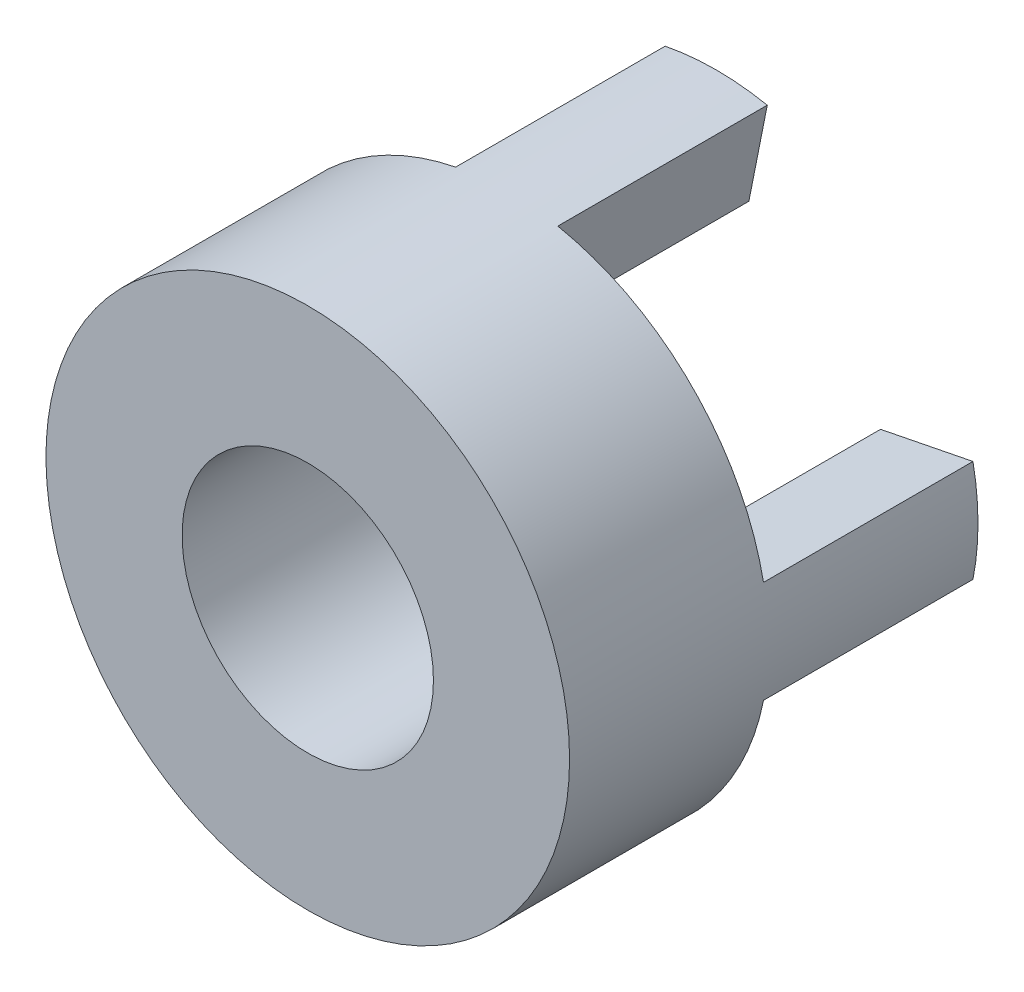
ISO-10303-21;
HEADER;
FILE_DESCRIPTION(('STEP AP214'),'2;1');
FILE_NAME('part.step','',(''),(''),'','','');
FILE_SCHEMA(('AUTOMOTIVE_DESIGN { 1 0 10303 214 1 1 1 1 }'));
ENDSEC;
DATA;
#1=APPLICATION_CONTEXT('core data for automotive mechanical design processes');
#2=APPLICATION_PROTOCOL_DEFINITION('international standard','automotive_design',2000,#1);
#3=PRODUCT_CONTEXT('',#1,'mechanical');
#4=PRODUCT('Part','Part','',(#3));
#5=PRODUCT_RELATED_PRODUCT_CATEGORY('part','',(#4));
#6=PRODUCT_DEFINITION_FORMATION('','',#4);
#7=PRODUCT_DEFINITION_CONTEXT('part definition',#1,'design');
#8=PRODUCT_DEFINITION('design','',#6,#7);
#9=PRODUCT_DEFINITION_SHAPE('','',#8);
#10=(LENGTH_UNIT() NAMED_UNIT(*) SI_UNIT(.MILLI.,.METRE.));
#11=(NAMED_UNIT(*) PLANE_ANGLE_UNIT() SI_UNIT($,.RADIAN.));
#12=(NAMED_UNIT(*) SI_UNIT($,.STERADIAN.) SOLID_ANGLE_UNIT());
#13=UNCERTAINTY_MEASURE_WITH_UNIT(LENGTH_MEASURE(1.E-05),#10,'distance_accuracy_value','');
#14=(GEOMETRIC_REPRESENTATION_CONTEXT(3) GLOBAL_UNCERTAINTY_ASSIGNED_CONTEXT((#13)) GLOBAL_UNIT_ASSIGNED_CONTEXT((#10,
#11,#12)) REPRESENTATION_CONTEXT('',''));
#15=CARTESIAN_POINT('',(0.,0.,0.));
#16=DIRECTION('',(0.,0.,1.));
#17=DIRECTION('',(1.,0.,0.));
#18=AXIS2_PLACEMENT_3D('',#15,#16,#17);
#19=CARTESIAN_POINT('',(0.,0.,0.));
#20=DIRECTION('',(0.,0.,1.));
#21=DIRECTION('',(1.,0.,0.));
#22=AXIS2_PLACEMENT_3D('',#19,#20,#21);
#23=PLANE('',#22);
#24=CARTESIAN_POINT('',(0.,0.,0.));
#25=DIRECTION('',(0.,0.,1.));
#26=DIRECTION('',(1.,0.,0.));
#27=AXIS2_PLACEMENT_3D('',#24,#25,#26);
#28=CIRCLE('',#27,6.);
#29=CARTESIAN_POINT('',(6.,0.,0.));
#30=VERTEX_POINT('',#29);
#31=EDGE_CURVE('E255',#30,#30,#28,.T.);
#32=ORIENTED_EDGE('',*,*,#31,.T.);
#33=EDGE_LOOP('',(#32));
#34=FACE_BOUND('',#33,.T.);
#35=DIRECTION('',(-0.195090322016129,-0.98078528040323,0.));
#36=VECTOR('',#35,1.);
#37=CARTESIAN_POINT('',(2.43862902520161,12.2598160050404,0.));
#38=LINE('',#37,#36);
#39=CARTESIAN_POINT('',(2.43862902520161,12.2598160050404,0.));
#40=VERTEX_POINT('',#39);
#41=CARTESIAN_POINT('',(1.56072257612903,7.84628224322584,0.));
#42=VERTEX_POINT('',#41);
#43=EDGE_CURVE('E477',#40,#42,#38,.T.);
#44=ORIENTED_EDGE('',*,*,#43,.F.);
#45=CARTESIAN_POINT('',(0.,0.,0.));
#46=DIRECTION('',(0.,0.,1.));
#47=DIRECTION('',(1.,0.,0.));
#48=AXIS2_PLACEMENT_3D('',#45,#46,#47);
#49=CIRCLE('',#48,12.5);
#50=CARTESIAN_POINT('',(12.2598160050404,2.43862902520161,0.));
#51=VERTEX_POINT('',#50);
#52=EDGE_CURVE('E169',#51,#40,#49,.T.);
#53=ORIENTED_EDGE('',*,*,#52,.F.);
#54=DIRECTION('',(0.98078528040323,0.195090322016129,0.));
#55=VECTOR('',#54,1.);
#56=CARTESIAN_POINT('',(7.84628224322584,1.56072257612903,0.));
#57=LINE('',#56,#55);
#58=CARTESIAN_POINT('',(7.84628224322584,1.56072257612903,0.));
#59=VERTEX_POINT('',#58);
#60=EDGE_CURVE('E182',#59,#51,#57,.T.);
#61=ORIENTED_EDGE('',*,*,#60,.F.);
#62=CARTESIAN_POINT('',(0.,0.,0.));
#63=DIRECTION('',(0.,0.,1.));
#64=DIRECTION('',(-1.,0.,0.));
#65=AXIS2_PLACEMENT_3D('',#62,#63,#64);
#66=CIRCLE('',#65,8.);
#67=CARTESIAN_POINT('',(7.84628224322584,-1.56072257612903,0.));
#68=VERTEX_POINT('',#67);
#69=EDGE_CURVE('E172',#68,#59,#66,.T.);
#70=ORIENTED_EDGE('',*,*,#69,.F.);
#71=DIRECTION('',(-0.98078528040323,0.195090322016129,0.));
#72=VECTOR('',#71,1.);
#73=CARTESIAN_POINT('',(12.2598160050404,-2.43862902520161,0.));
#74=LINE('',#73,#72);
#75=CARTESIAN_POINT('',(12.2598160050404,-2.43862902520161,0.));
#76=VERTEX_POINT('',#75);
#77=EDGE_CURVE('E170',#76,#68,#74,.T.);
#78=ORIENTED_EDGE('',*,*,#77,.F.);
#79=CARTESIAN_POINT('',(2.43862902520161,-12.2598160050404,0.));
#80=VERTEX_POINT('',#79);
#81=EDGE_CURVE('E461',#80,#76,#49,.T.);
#82=ORIENTED_EDGE('',*,*,#81,.F.);
#83=DIRECTION('',(0.195090322016129,-0.98078528040323,0.));
#84=VECTOR('',#83,1.);
#85=CARTESIAN_POINT('',(1.56072257612903,-7.84628224322584,0.));
#86=LINE('',#85,#84);
#87=CARTESIAN_POINT('',(1.56072257612903,-7.84628224322584,0.));
#88=VERTEX_POINT('',#87);
#89=EDGE_CURVE('E204',#88,#80,#86,.T.);
#90=ORIENTED_EDGE('',*,*,#89,.F.);
#91=CARTESIAN_POINT('',(0.,0.,0.));
#92=DIRECTION('',(0.,0.,1.));
#93=DIRECTION('',(-1.,0.,0.));
#94=AXIS2_PLACEMENT_3D('',#91,#92,#93);
#95=CIRCLE('',#94,8.);
#96=CARTESIAN_POINT('',(-1.56072257612901,-7.84628224322585,0.));
#97=VERTEX_POINT('',#96);
#98=EDGE_CURVE('E212',#97,#88,#95,.T.);
#99=ORIENTED_EDGE('',*,*,#98,.F.);
#100=DIRECTION('',(0.195090322016133,0.980785280403229,0.));
#101=VECTOR('',#100,1.);
#102=CARTESIAN_POINT('',(-2.43862902520161,-12.2598160050404,0.));
#103=LINE('',#102,#101);
#104=CARTESIAN_POINT('',(-2.43862902520161,-12.2598160050404,0.));
#105=VERTEX_POINT('',#104);
#106=EDGE_CURVE('E199',#105,#97,#103,.T.);
#107=ORIENTED_EDGE('',*,*,#106,.F.);
#108=CARTESIAN_POINT('',(-12.2598160050404,-2.43862902520161,0.));
#109=VERTEX_POINT('',#108);
#110=EDGE_CURVE('E39',#109,#105,#49,.T.);
#111=ORIENTED_EDGE('',*,*,#110,.F.);
#112=DIRECTION('',(-0.98078528040323,-0.195090322016129,0.));
#113=VECTOR('',#112,1.);
#114=CARTESIAN_POINT('',(-7.84628224322584,-1.56072257612903,0.));
#115=LINE('',#114,#113);
#116=CARTESIAN_POINT('',(-7.84628224322584,-1.56072257612903,0.));
#117=VERTEX_POINT('',#116);
#118=EDGE_CURVE('E230',#117,#109,#115,.T.);
#119=ORIENTED_EDGE('',*,*,#118,.F.);
#120=CARTESIAN_POINT('',(0.,0.,0.));
#121=DIRECTION('',(0.,0.,1.));
#122=DIRECTION('',(-1.,0.,0.));
#123=AXIS2_PLACEMENT_3D('',#120,#121,#122);
#124=CIRCLE('',#123,8.);
#125=CARTESIAN_POINT('',(-7.84628224322584,1.56072257612903,0.));
#126=VERTEX_POINT('',#125);
#127=EDGE_CURVE('E239',#126,#117,#124,.T.);
#128=ORIENTED_EDGE('',*,*,#127,.F.);
#129=DIRECTION('',(0.98078528040323,-0.195090322016129,0.));
#130=VECTOR('',#129,1.);
#131=CARTESIAN_POINT('',(-12.2598160050404,2.43862902520161,0.));
#132=LINE('',#131,#130);
#133=CARTESIAN_POINT('',(-12.2598160050404,2.43862902520161,0.));
#134=VERTEX_POINT('',#133);
#135=EDGE_CURVE('E225',#134,#126,#132,.T.);
#136=ORIENTED_EDGE('',*,*,#135,.F.);
#137=CARTESIAN_POINT('',(-2.43862902520161,12.2598160050404,0.));
#138=VERTEX_POINT('',#137);
#139=EDGE_CURVE('E259',#138,#134,#49,.T.);
#140=ORIENTED_EDGE('',*,*,#139,.F.);
#141=DIRECTION('',(-0.195090322016129,0.98078528040323,0.));
#142=VECTOR('',#141,1.);
#143=CARTESIAN_POINT('',(-1.56072257612903,7.84628224322584,0.));
#144=LINE('',#143,#142);
#145=CARTESIAN_POINT('',(-1.56072257612903,7.84628224322584,0.));
#146=VERTEX_POINT('',#145);
#147=EDGE_CURVE('E165',#146,#138,#144,.T.);
#148=ORIENTED_EDGE('',*,*,#147,.F.);
#149=CARTESIAN_POINT('',(0.,0.,0.));
#150=DIRECTION('',(0.,0.,1.));
#151=DIRECTION('',(-1.,0.,0.));
#152=AXIS2_PLACEMENT_3D('',#149,#150,#151);
#153=CIRCLE('',#152,8.);
#154=EDGE_CURVE('E457',#42,#146,#153,.T.);
#155=ORIENTED_EDGE('',*,*,#154,.F.);
#156=EDGE_LOOP('',(#44,#53,#61,#70,#78,#82,#90,#99,#107,#111,#119,#128,#136,#140,#148,#155));
#157=FACE_BOUND('',#156,.T.);
#158=ADVANCED_FACE('F35',(#34,#157),#23,.F.);
#159=CARTESIAN_POINT('',(0.,0.,9.5));
#160=DIRECTION('',(0.,0.,1.));
#161=DIRECTION('',(1.,0.,0.));
#162=AXIS2_PLACEMENT_3D('',#159,#160,#161);
#163=PLANE('',#162);
#164=CARTESIAN_POINT('',(0.,0.,9.5));
#165=DIRECTION('',(0.,0.,1.));
#166=DIRECTION('',(1.,0.,0.));
#167=AXIS2_PLACEMENT_3D('',#164,#165,#166);
#168=CIRCLE('',#167,12.5);
#169=CARTESIAN_POINT('',(12.5,0.,9.5));
#170=VERTEX_POINT('',#169);
#171=EDGE_CURVE('E11',#170,#170,#168,.T.);
#172=ORIENTED_EDGE('',*,*,#171,.T.);
#173=EDGE_LOOP('',(#172));
#174=FACE_BOUND('',#173,.T.);
#175=CARTESIAN_POINT('',(0.,0.,9.5));
#176=DIRECTION('',(0.,0.,1.));
#177=DIRECTION('',(1.,0.,0.));
#178=AXIS2_PLACEMENT_3D('',#175,#176,#177);
#179=CIRCLE('',#178,6.);
#180=CARTESIAN_POINT('',(6.,0.,9.5));
#181=VERTEX_POINT('',#180);
#182=EDGE_CURVE('E256',#181,#181,#179,.T.);
#183=ORIENTED_EDGE('',*,*,#182,.F.);
#184=EDGE_LOOP('',(#183));
#185=FACE_BOUND('',#184,.T.);
#186=ADVANCED_FACE('F277',(#174,#185),#163,.T.);
#187=CARTESIAN_POINT('',(0.,0.,9.5));
#188=DIRECTION('',(0.,0.,-1.));
#189=DIRECTION('',(-1.,0.,0.));
#190=AXIS2_PLACEMENT_3D('',#187,#188,#189);
#191=CYLINDRICAL_SURFACE('',#190,12.5);
#192=ORIENTED_EDGE('',*,*,#171,.F.);
#193=EDGE_LOOP('',(#192));
#194=FACE_BOUND('',#193,.T.);
#195=ORIENTED_EDGE('',*,*,#110,.T.);
#196=DIRECTION('',(0.,0.,1.));
#197=VECTOR('',#196,1.);
#198=CARTESIAN_POINT('',(-2.43862902520161,-12.2598160050404,-10.));
#199=LINE('',#198,#197);
#200=CARTESIAN_POINT('',(-2.43862902520161,-12.2598160050404,-10.));
#201=VERTEX_POINT('',#200);
#202=EDGE_CURVE('E223',#201,#105,#199,.T.);
#203=ORIENTED_EDGE('',*,*,#202,.F.);
#204=CARTESIAN_POINT('',(0.,0.,-10.));
#205=DIRECTION('',(0.,0.,-1.));
#206=DIRECTION('',(-1.,0.,0.));
#207=AXIS2_PLACEMENT_3D('',#204,#205,#206);
#208=CIRCLE('',#207,12.5);
#209=CARTESIAN_POINT('',(2.43862902520161,-12.2598160050404,-10.));
#210=VERTEX_POINT('',#209);
#211=EDGE_CURVE('E200',#210,#201,#208,.T.);
#212=ORIENTED_EDGE('',*,*,#211,.F.);
#213=DIRECTION('',(0.,0.,1.));
#214=VECTOR('',#213,1.);
#215=CARTESIAN_POINT('',(2.43862902520161,-12.2598160050404,-10.));
#216=LINE('',#215,#214);
#217=EDGE_CURVE('E210',#210,#80,#216,.T.);
#218=ORIENTED_EDGE('',*,*,#217,.T.);
#219=ORIENTED_EDGE('',*,*,#81,.T.);
#220=DIRECTION('',(0.,0.,1.));
#221=VECTOR('',#220,1.);
#222=CARTESIAN_POINT('',(12.2598160050404,-2.43862902520161,-10.));
#223=LINE('',#222,#221);
#224=CARTESIAN_POINT('',(12.2598160050404,-2.43862902520161,-10.));
#225=VERTEX_POINT('',#224);
#226=EDGE_CURVE('E197',#225,#76,#223,.T.);
#227=ORIENTED_EDGE('',*,*,#226,.F.);
#228=CARTESIAN_POINT('',(0.,0.,-10.));
#229=DIRECTION('',(0.,0.,-1.));
#230=DIRECTION('',(-1.,0.,0.));
#231=AXIS2_PLACEMENT_3D('',#228,#229,#230);
#232=CIRCLE('',#231,12.5);
#233=CARTESIAN_POINT('',(12.2598160050404,2.43862902520161,-10.));
#234=VERTEX_POINT('',#233);
#235=EDGE_CURVE('E178',#234,#225,#232,.T.);
#236=ORIENTED_EDGE('',*,*,#235,.F.);
#237=DIRECTION('',(0.,0.,1.));
#238=VECTOR('',#237,1.);
#239=CARTESIAN_POINT('',(12.2598160050404,2.43862902520161,-10.));
#240=LINE('',#239,#238);
#241=EDGE_CURVE('E57',#234,#51,#240,.T.);
#242=ORIENTED_EDGE('',*,*,#241,.T.);
#243=ORIENTED_EDGE('',*,*,#52,.T.);
#244=DIRECTION('',(0.,0.,1.));
#245=VECTOR('',#244,1.);
#246=CARTESIAN_POINT('',(2.43862902520161,12.2598160050404,-10.));
#247=LINE('',#246,#245);
#248=CARTESIAN_POINT('',(2.43862902520161,12.2598160050404,-10.));
#249=VERTEX_POINT('',#248);
#250=EDGE_CURVE('E153',#249,#40,#247,.T.);
#251=ORIENTED_EDGE('',*,*,#250,.F.);
#252=CARTESIAN_POINT('',(0.,0.,-10.));
#253=DIRECTION('',(0.,0.,-1.));
#254=DIRECTION('',(-1.,0.,0.));
#255=AXIS2_PLACEMENT_3D('',#252,#253,#254);
#256=CIRCLE('',#255,12.5);
#257=CARTESIAN_POINT('',(-2.43862902520161,12.2598160050404,-10.));
#258=VERTEX_POINT('',#257);
#259=EDGE_CURVE('E160',#258,#249,#256,.T.);
#260=ORIENTED_EDGE('',*,*,#259,.F.);
#261=DIRECTION('',(0.,0.,1.));
#262=VECTOR('',#261,1.);
#263=CARTESIAN_POINT('',(-2.43862902520161,12.2598160050404,-10.));
#264=LINE('',#263,#262);
#265=EDGE_CURVE('E50',#258,#138,#264,.T.);
#266=ORIENTED_EDGE('',*,*,#265,.T.);
#267=ORIENTED_EDGE('',*,*,#139,.T.);
#268=DIRECTION('',(0.,0.,1.));
#269=VECTOR('',#268,1.);
#270=CARTESIAN_POINT('',(-12.2598160050404,2.43862902520161,-10.));
#271=LINE('',#270,#269);
#272=CARTESIAN_POINT('',(-12.2598160050404,2.43862902520161,-10.));
#273=VERTEX_POINT('',#272);
#274=EDGE_CURVE('E252',#273,#134,#271,.T.);
#275=ORIENTED_EDGE('',*,*,#274,.F.);
#276=CARTESIAN_POINT('',(0.,0.,-10.));
#277=DIRECTION('',(0.,0.,-1.));
#278=DIRECTION('',(-1.,0.,0.));
#279=AXIS2_PLACEMENT_3D('',#276,#277,#278);
#280=CIRCLE('',#279,12.5);
#281=CARTESIAN_POINT('',(-12.2598160050404,-2.43862902520161,-10.));
#282=VERTEX_POINT('',#281);
#283=EDGE_CURVE('E226',#282,#273,#280,.T.);
#284=ORIENTED_EDGE('',*,*,#283,.F.);
#285=DIRECTION('',(0.,0.,1.));
#286=VECTOR('',#285,1.);
#287=CARTESIAN_POINT('',(-12.2598160050404,-2.43862902520161,-10.));
#288=LINE('',#287,#286);
#289=EDGE_CURVE('E236',#282,#109,#288,.T.);
#290=ORIENTED_EDGE('',*,*,#289,.T.);
#291=EDGE_LOOP('',(#195,#203,#212,#218,#219,#227,#236,#242,#243,#251,#260,#266,#267,#275,#284,#290));
#292=FACE_BOUND('',#291,.T.);
#293=ADVANCED_FACE('F37',(#194,#292),#191,.T.);
#294=CARTESIAN_POINT('',(0.,0.,9.5));
#295=DIRECTION('',(0.,0.,-1.));
#296=DIRECTION('',(-1.,0.,0.));
#297=AXIS2_PLACEMENT_3D('',#294,#295,#296);
#298=CYLINDRICAL_SURFACE('',#297,6.);
#299=ORIENTED_EDGE('',*,*,#182,.T.);
#300=EDGE_LOOP('',(#299));
#301=FACE_BOUND('',#300,.T.);
#302=ORIENTED_EDGE('',*,*,#31,.F.);
#303=EDGE_LOOP('',(#302));
#304=FACE_BOUND('',#303,.T.);
#305=ADVANCED_FACE('F265',(#301,#304),#298,.F.);
#306=CARTESIAN_POINT('',(-12.2598160050404,2.43862902520161,-10.));
#307=DIRECTION('',(-0.195090322016129,-0.98078528040323,0.));
#308=DIRECTION('',(0.98078528040323,-0.195090322016129,0.));
#309=AXIS2_PLACEMENT_3D('',#306,#307,#308);
#310=PLANE('',#309);
#311=ORIENTED_EDGE('',*,*,#135,.T.);
#312=DIRECTION('',(0.,0.,1.));
#313=VECTOR('',#312,1.);
#314=CARTESIAN_POINT('',(-7.84628224322584,1.56072257612903,-10.));
#315=LINE('',#314,#313);
#316=CARTESIAN_POINT('',(-7.84628224322584,1.56072257612903,-10.));
#317=VERTEX_POINT('',#316);
#318=EDGE_CURVE('E249',#317,#126,#315,.T.);
#319=ORIENTED_EDGE('',*,*,#318,.F.);
#320=DIRECTION('',(0.98078528040323,-0.195090322016129,0.));
#321=VECTOR('',#320,1.);
#322=CARTESIAN_POINT('',(-12.2598160050404,2.43862902520161,-10.));
#323=LINE('',#322,#321);
#324=EDGE_CURVE('E229',#273,#317,#323,.T.);
#325=ORIENTED_EDGE('',*,*,#324,.F.);
#326=ORIENTED_EDGE('',*,*,#274,.T.);
#327=EDGE_LOOP('',(#311,#319,#325,#326));
#328=FACE_BOUND('',#327,.T.);
#329=ADVANCED_FACE('F267',(#328),#310,.F.);
#330=CARTESIAN_POINT('',(0.,0.,-10.));
#331=DIRECTION('',(0.,0.,1.));
#332=DIRECTION('',(1.,0.,0.));
#333=AXIS2_PLACEMENT_3D('',#330,#331,#332);
#334=CYLINDRICAL_SURFACE('',#333,8.);
#335=ORIENTED_EDGE('',*,*,#127,.T.);
#336=DIRECTION('',(0.,0.,1.));
#337=VECTOR('',#336,1.);
#338=CARTESIAN_POINT('',(-7.84628224322584,-1.56072257612903,-10.));
#339=LINE('',#338,#337);
#340=CARTESIAN_POINT('',(-7.84628224322584,-1.56072257612903,-10.));
#341=VERTEX_POINT('',#340);
#342=EDGE_CURVE('E246',#341,#117,#339,.T.);
#343=ORIENTED_EDGE('',*,*,#342,.F.);
#344=CARTESIAN_POINT('',(0.,0.,-10.));
#345=DIRECTION('',(0.,0.,1.));
#346=DIRECTION('',(-1.,0.,0.));
#347=AXIS2_PLACEMENT_3D('',#344,#345,#346);
#348=CIRCLE('',#347,8.);
#349=EDGE_CURVE('E232',#317,#341,#348,.T.);
#350=ORIENTED_EDGE('',*,*,#349,.F.);
#351=ORIENTED_EDGE('',*,*,#318,.T.);
#352=EDGE_LOOP('',(#335,#343,#350,#351));
#353=FACE_BOUND('',#352,.T.);
#354=ADVANCED_FACE('F274',(#353),#334,.F.);
#355=CARTESIAN_POINT('',(-7.84628224322584,-1.56072257612903,-10.));
#356=DIRECTION('',(-0.195090322016129,0.98078528040323,0.));
#357=DIRECTION('',(-0.98078528040323,-0.195090322016129,0.));
#358=AXIS2_PLACEMENT_3D('',#355,#356,#357);
#359=PLANE('',#358);
#360=ORIENTED_EDGE('',*,*,#118,.T.);
#361=ORIENTED_EDGE('',*,*,#289,.F.);
#362=DIRECTION('',(-0.98078528040323,-0.195090322016129,0.));
#363=VECTOR('',#362,1.);
#364=CARTESIAN_POINT('',(-7.84628224322584,-1.56072257612903,-10.));
#365=LINE('',#364,#363);
#366=EDGE_CURVE('E234',#341,#282,#365,.T.);
#367=ORIENTED_EDGE('',*,*,#366,.F.);
#368=ORIENTED_EDGE('',*,*,#342,.T.);
#369=EDGE_LOOP('',(#360,#361,#367,#368));
#370=FACE_BOUND('',#369,.T.);
#371=ADVANCED_FACE('F312',(#370),#359,.F.);
#372=CARTESIAN_POINT('',(0.,0.,-10.));
#373=DIRECTION('',(0.,0.,-1.));
#374=DIRECTION('',(-1.,0.,0.));
#375=AXIS2_PLACEMENT_3D('',#372,#373,#374);
#376=PLANE('',#375);
#377=ORIENTED_EDGE('',*,*,#283,.T.);
#378=ORIENTED_EDGE('',*,*,#324,.T.);
#379=ORIENTED_EDGE('',*,*,#349,.T.);
#380=ORIENTED_EDGE('',*,*,#366,.T.);
#381=EDGE_LOOP('',(#377,#378,#379,#380));
#382=FACE_BOUND('',#381,.T.);
#383=ADVANCED_FACE('F322',(#382),#376,.T.);
#384=CARTESIAN_POINT('',(-2.43862902520161,-12.2598160050404,-10.));
#385=DIRECTION('',(0.980785280403229,-0.195090322016133,0.));
#386=DIRECTION('',(0.195090322016133,0.98078528040323,0.));
#387=AXIS2_PLACEMENT_3D('',#384,#385,#386);
#388=PLANE('',#387);
#389=ORIENTED_EDGE('',*,*,#106,.T.);
#390=DIRECTION('',(0.,0.,1.));
#391=VECTOR('',#390,1.);
#392=CARTESIAN_POINT('',(-1.56072257612901,-7.84628224322585,-10.));
#393=LINE('',#392,#391);
#394=CARTESIAN_POINT('',(-1.56072257612901,-7.84628224322585,-10.));
#395=VERTEX_POINT('',#394);
#396=EDGE_CURVE('E220',#395,#97,#393,.T.);
#397=ORIENTED_EDGE('',*,*,#396,.F.);
#398=DIRECTION('',(0.195090322016133,0.980785280403229,0.));
#399=VECTOR('',#398,1.);
#400=CARTESIAN_POINT('',(-2.43862902520161,-12.2598160050404,-10.));
#401=LINE('',#400,#399);
#402=EDGE_CURVE('E203',#201,#395,#401,.T.);
#403=ORIENTED_EDGE('',*,*,#402,.F.);
#404=ORIENTED_EDGE('',*,*,#202,.T.);
#405=EDGE_LOOP('',(#389,#397,#403,#404));
#406=FACE_BOUND('',#405,.T.);
#407=ADVANCED_FACE('F332',(#406),#388,.F.);
#408=CARTESIAN_POINT('',(0.,0.,-10.));
#409=DIRECTION('',(0.,0.,1.));
#410=DIRECTION('',(1.,0.,0.));
#411=AXIS2_PLACEMENT_3D('',#408,#409,#410);
#412=CYLINDRICAL_SURFACE('',#411,8.);
#413=ORIENTED_EDGE('',*,*,#98,.T.);
#414=DIRECTION('',(0.,0.,1.));
#415=VECTOR('',#414,1.);
#416=CARTESIAN_POINT('',(1.56072257612903,-7.84628224322584,-10.));
#417=LINE('',#416,#415);
#418=CARTESIAN_POINT('',(1.56072257612903,-7.84628224322584,-10.));
#419=VERTEX_POINT('',#418);
#420=EDGE_CURVE('E217',#419,#88,#417,.T.);
#421=ORIENTED_EDGE('',*,*,#420,.F.);
#422=CARTESIAN_POINT('',(0.,0.,-10.));
#423=DIRECTION('',(0.,0.,1.));
#424=DIRECTION('',(-1.,0.,0.));
#425=AXIS2_PLACEMENT_3D('',#422,#423,#424);
#426=CIRCLE('',#425,8.);
#427=EDGE_CURVE('E206',#395,#419,#426,.T.);
#428=ORIENTED_EDGE('',*,*,#427,.F.);
#429=ORIENTED_EDGE('',*,*,#396,.T.);
#430=EDGE_LOOP('',(#413,#421,#428,#429));
#431=FACE_BOUND('',#430,.T.);
#432=ADVANCED_FACE('F342',(#431),#412,.F.);
#433=CARTESIAN_POINT('',(1.56072257612903,-7.84628224322584,-10.));
#434=DIRECTION('',(-0.98078528040323,-0.195090322016129,0.));
#435=DIRECTION('',(0.195090322016129,-0.98078528040323,0.));
#436=AXIS2_PLACEMENT_3D('',#433,#434,#435);
#437=PLANE('',#436);
#438=ORIENTED_EDGE('',*,*,#89,.T.);
#439=ORIENTED_EDGE('',*,*,#217,.F.);
#440=DIRECTION('',(0.195090322016129,-0.98078528040323,0.));
#441=VECTOR('',#440,1.);
#442=CARTESIAN_POINT('',(1.56072257612903,-7.84628224322584,-10.));
#443=LINE('',#442,#441);
#444=EDGE_CURVE('E208',#419,#210,#443,.T.);
#445=ORIENTED_EDGE('',*,*,#444,.F.);
#446=ORIENTED_EDGE('',*,*,#420,.T.);
#447=EDGE_LOOP('',(#438,#439,#445,#446));
#448=FACE_BOUND('',#447,.T.);
#449=ADVANCED_FACE('F352',(#448),#437,.F.);
#450=CARTESIAN_POINT('',(0.,0.,-10.));
#451=DIRECTION('',(0.,0.,-1.));
#452=DIRECTION('',(-1.,0.,0.));
#453=AXIS2_PLACEMENT_3D('',#450,#451,#452);
#454=PLANE('',#453);
#455=ORIENTED_EDGE('',*,*,#211,.T.);
#456=ORIENTED_EDGE('',*,*,#402,.T.);
#457=ORIENTED_EDGE('',*,*,#427,.T.);
#458=ORIENTED_EDGE('',*,*,#444,.T.);
#459=EDGE_LOOP('',(#455,#456,#457,#458));
#460=FACE_BOUND('',#459,.T.);
#461=ADVANCED_FACE('F362',(#460),#454,.T.);
#462=CARTESIAN_POINT('',(12.2598160050404,-2.43862902520161,-10.));
#463=DIRECTION('',(0.195090322016129,0.98078528040323,0.));
#464=DIRECTION('',(-0.98078528040323,0.195090322016129,0.));
#465=AXIS2_PLACEMENT_3D('',#462,#463,#464);
#466=PLANE('',#465);
#467=ORIENTED_EDGE('',*,*,#77,.T.);
#468=DIRECTION('',(0.,0.,1.));
#469=VECTOR('',#468,1.);
#470=CARTESIAN_POINT('',(7.84628224322584,-1.56072257612903,-10.));
#471=LINE('',#470,#469);
#472=CARTESIAN_POINT('',(7.84628224322584,-1.56072257612903,-10.));
#473=VERTEX_POINT('',#472);
#474=EDGE_CURVE('E194',#473,#68,#471,.T.);
#475=ORIENTED_EDGE('',*,*,#474,.F.);
#476=DIRECTION('',(-0.98078528040323,0.195090322016129,0.));
#477=VECTOR('',#476,1.);
#478=CARTESIAN_POINT('',(12.2598160050404,-2.43862902520161,-10.));
#479=LINE('',#478,#477);
#480=EDGE_CURVE('E181',#225,#473,#479,.T.);
#481=ORIENTED_EDGE('',*,*,#480,.F.);
#482=ORIENTED_EDGE('',*,*,#226,.T.);
#483=EDGE_LOOP('',(#467,#475,#481,#482));
#484=FACE_BOUND('',#483,.T.);
#485=ADVANCED_FACE('F372',(#484),#466,.F.);
#486=CARTESIAN_POINT('',(0.,0.,-10.));
#487=DIRECTION('',(0.,0.,1.));
#488=DIRECTION('',(1.,0.,0.));
#489=AXIS2_PLACEMENT_3D('',#486,#487,#488);
#490=CYLINDRICAL_SURFACE('',#489,8.);
#491=ORIENTED_EDGE('',*,*,#69,.T.);
#492=DIRECTION('',(0.,0.,1.));
#493=VECTOR('',#492,1.);
#494=CARTESIAN_POINT('',(7.84628224322584,1.56072257612903,-10.));
#495=LINE('',#494,#493);
#496=CARTESIAN_POINT('',(7.84628224322584,1.56072257612903,-10.));
#497=VERTEX_POINT('',#496);
#498=EDGE_CURVE('E191',#497,#59,#495,.T.);
#499=ORIENTED_EDGE('',*,*,#498,.F.);
#500=CARTESIAN_POINT('',(0.,0.,-10.));
#501=DIRECTION('',(0.,0.,1.));
#502=DIRECTION('',(-1.,0.,0.));
#503=AXIS2_PLACEMENT_3D('',#500,#501,#502);
#504=CIRCLE('',#503,8.);
#505=EDGE_CURVE('E184',#473,#497,#504,.T.);
#506=ORIENTED_EDGE('',*,*,#505,.F.);
#507=ORIENTED_EDGE('',*,*,#474,.T.);
#508=EDGE_LOOP('',(#491,#499,#506,#507));
#509=FACE_BOUND('',#508,.T.);
#510=ADVANCED_FACE('F382',(#509),#490,.F.);
#511=CARTESIAN_POINT('',(7.84628224322584,1.56072257612903,-10.));
#512=DIRECTION('',(0.195090322016129,-0.98078528040323,0.));
#513=DIRECTION('',(0.98078528040323,0.195090322016129,0.));
#514=AXIS2_PLACEMENT_3D('',#511,#512,#513);
#515=PLANE('',#514);
#516=ORIENTED_EDGE('',*,*,#60,.T.);
#517=ORIENTED_EDGE('',*,*,#241,.F.);
#518=DIRECTION('',(0.98078528040323,0.195090322016129,0.));
#519=VECTOR('',#518,1.);
#520=CARTESIAN_POINT('',(7.84628224322584,1.56072257612903,-10.));
#521=LINE('',#520,#519);
#522=EDGE_CURVE('E186',#497,#234,#521,.T.);
#523=ORIENTED_EDGE('',*,*,#522,.F.);
#524=ORIENTED_EDGE('',*,*,#498,.T.);
#525=EDGE_LOOP('',(#516,#517,#523,#524));
#526=FACE_BOUND('',#525,.T.);
#527=ADVANCED_FACE('F392',(#526),#515,.F.);
#528=CARTESIAN_POINT('',(0.,0.,-10.));
#529=DIRECTION('',(0.,0.,-1.));
#530=DIRECTION('',(-1.,0.,0.));
#531=AXIS2_PLACEMENT_3D('',#528,#529,#530);
#532=PLANE('',#531);
#533=ORIENTED_EDGE('',*,*,#235,.T.);
#534=ORIENTED_EDGE('',*,*,#480,.T.);
#535=ORIENTED_EDGE('',*,*,#505,.T.);
#536=ORIENTED_EDGE('',*,*,#522,.T.);
#537=EDGE_LOOP('',(#533,#534,#535,#536));
#538=FACE_BOUND('',#537,.T.);
#539=ADVANCED_FACE('F402',(#538),#532,.T.);
#540=CARTESIAN_POINT('',(2.43862902520161,12.2598160050404,-10.));
#541=DIRECTION('',(-0.98078528040323,0.195090322016129,0.));
#542=DIRECTION('',(-0.195090322016129,-0.98078528040323,0.));
#543=AXIS2_PLACEMENT_3D('',#540,#541,#542);
#544=PLANE('',#543);
#545=ORIENTED_EDGE('',*,*,#43,.T.);
#546=DIRECTION('',(0.,0.,1.));
#547=VECTOR('',#546,1.);
#548=CARTESIAN_POINT('',(1.56072257612903,7.84628224322584,-10.));
#549=LINE('',#548,#547);
#550=CARTESIAN_POINT('',(1.56072257612903,7.84628224322584,-10.));
#551=VERTEX_POINT('',#550);
#552=EDGE_CURVE('E156',#551,#42,#549,.T.);
#553=ORIENTED_EDGE('',*,*,#552,.F.);
#554=DIRECTION('',(-0.195090322016129,-0.98078528040323,0.));
#555=VECTOR('',#554,1.);
#556=CARTESIAN_POINT('',(2.43862902520161,12.2598160050404,-10.));
#557=LINE('',#556,#555);
#558=EDGE_CURVE('E149',#249,#551,#557,.T.);
#559=ORIENTED_EDGE('',*,*,#558,.F.);
#560=ORIENTED_EDGE('',*,*,#250,.T.);
#561=EDGE_LOOP('',(#545,#553,#559,#560));
#562=FACE_BOUND('',#561,.T.);
#563=ADVANCED_FACE('F151',(#562),#544,.F.);
#564=CARTESIAN_POINT('',(0.,0.,-10.));
#565=DIRECTION('',(0.,0.,1.));
#566=DIRECTION('',(1.,0.,0.));
#567=AXIS2_PLACEMENT_3D('',#564,#565,#566);
#568=CYLINDRICAL_SURFACE('',#567,8.);
#569=ORIENTED_EDGE('',*,*,#154,.T.);
#570=DIRECTION('',(0.,0.,1.));
#571=VECTOR('',#570,1.);
#572=CARTESIAN_POINT('',(-1.56072257612903,7.84628224322584,-10.));
#573=LINE('',#572,#571);
#574=CARTESIAN_POINT('',(-1.56072257612903,7.84628224322584,-10.));
#575=VERTEX_POINT('',#574);
#576=EDGE_CURVE('E174',#575,#146,#573,.T.);
#577=ORIENTED_EDGE('',*,*,#576,.F.);
#578=CARTESIAN_POINT('',(0.,0.,-10.));
#579=DIRECTION('',(0.,0.,1.));
#580=DIRECTION('',(-1.,0.,0.));
#581=AXIS2_PLACEMENT_3D('',#578,#579,#580);
#582=CIRCLE('',#581,8.);
#583=EDGE_CURVE('E159',#551,#575,#582,.T.);
#584=ORIENTED_EDGE('',*,*,#583,.F.);
#585=ORIENTED_EDGE('',*,*,#552,.T.);
#586=EDGE_LOOP('',(#569,#577,#584,#585));
#587=FACE_BOUND('',#586,.T.);
#588=ADVANCED_FACE('F421',(#587),#568,.F.);
#589=CARTESIAN_POINT('',(-1.56072257612903,7.84628224322584,-10.));
#590=DIRECTION('',(0.98078528040323,0.195090322016129,0.));
#591=DIRECTION('',(-0.195090322016129,0.980785280403231,0.));
#592=AXIS2_PLACEMENT_3D('',#589,#590,#591);
#593=PLANE('',#592);
#594=ORIENTED_EDGE('',*,*,#147,.T.);
#595=ORIENTED_EDGE('',*,*,#265,.F.);
#596=DIRECTION('',(-0.195090322016129,0.98078528040323,0.));
#597=VECTOR('',#596,1.);
#598=CARTESIAN_POINT('',(-1.56072257612903,7.84628224322584,-10.));
#599=LINE('',#598,#597);
#600=EDGE_CURVE('E164',#575,#258,#599,.T.);
#601=ORIENTED_EDGE('',*,*,#600,.F.);
#602=ORIENTED_EDGE('',*,*,#576,.T.);
#603=EDGE_LOOP('',(#594,#595,#601,#602));
#604=FACE_BOUND('',#603,.T.);
#605=ADVANCED_FACE('F430',(#604),#593,.F.);
#606=CARTESIAN_POINT('',(0.,0.,-10.));
#607=DIRECTION('',(0.,0.,-1.));
#608=DIRECTION('',(-1.,0.,0.));
#609=AXIS2_PLACEMENT_3D('',#606,#607,#608);
#610=PLANE('',#609);
#611=ORIENTED_EDGE('',*,*,#259,.T.);
#612=ORIENTED_EDGE('',*,*,#558,.T.);
#613=ORIENTED_EDGE('',*,*,#583,.T.);
#614=ORIENTED_EDGE('',*,*,#600,.T.);
#615=EDGE_LOOP('',(#611,#612,#613,#614));
#616=FACE_BOUND('',#615,.T.);
#617=ADVANCED_FACE('F162',(#616),#610,.T.);
#618=CLOSED_SHELL('',(#158,#186,#293,#305,#329,#354,#371,#383,#407,#432,#449,#461,#485,#510,
#527,#539,#563,#588,#605,#617));
#619=MANIFOLD_SOLID_BREP('B2',#618);
#620=ADVANCED_BREP_SHAPE_REPRESENTATION('',(#18,#619),#14);
#621=SHAPE_DEFINITION_REPRESENTATION(#9,#620);
ENDSEC;
END-ISO-10303-21;
